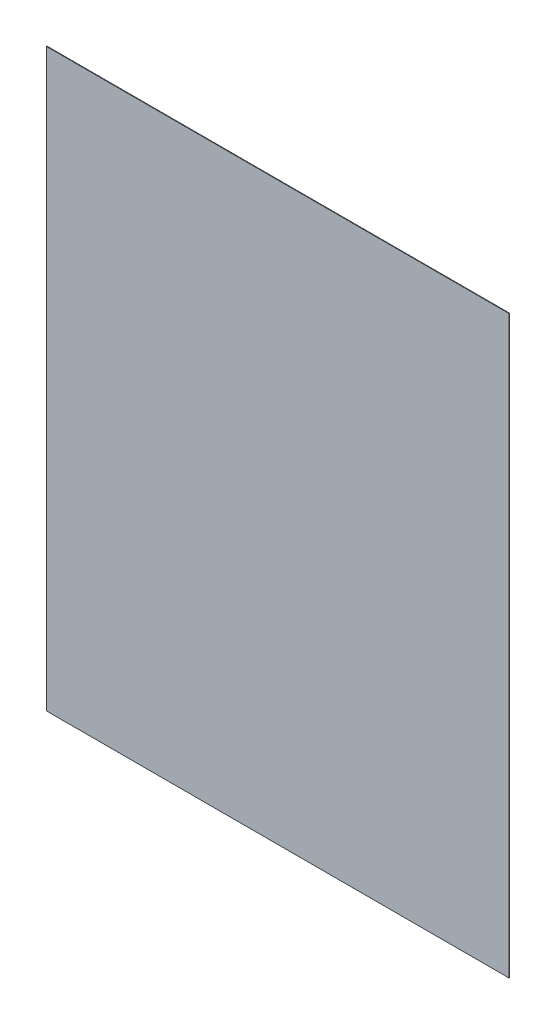
ISO-10303-21;
HEADER;
FILE_DESCRIPTION(('STEP AP214'),'2;1');
FILE_NAME('part.step','',(''),(''),'','','');
FILE_SCHEMA(('AUTOMOTIVE_DESIGN { 1 0 10303 214 1 1 1 1 }'));
ENDSEC;
DATA;
#1=APPLICATION_CONTEXT('core data for automotive mechanical design processes');
#2=APPLICATION_PROTOCOL_DEFINITION('international standard','automotive_design',2000,#1);
#3=PRODUCT_CONTEXT('',#1,'mechanical');
#4=PRODUCT('Part','Part','',(#3));
#5=PRODUCT_RELATED_PRODUCT_CATEGORY('part','',(#4));
#6=PRODUCT_DEFINITION_FORMATION('','',#4);
#7=PRODUCT_DEFINITION_CONTEXT('part definition',#1,'design');
#8=PRODUCT_DEFINITION('design','',#6,#7);
#9=PRODUCT_DEFINITION_SHAPE('','',#8);
#10=(LENGTH_UNIT() NAMED_UNIT(*) SI_UNIT(.MILLI.,.METRE.));
#11=(NAMED_UNIT(*) PLANE_ANGLE_UNIT() SI_UNIT($,.RADIAN.));
#12=(NAMED_UNIT(*) SI_UNIT($,.STERADIAN.) SOLID_ANGLE_UNIT());
#13=UNCERTAINTY_MEASURE_WITH_UNIT(LENGTH_MEASURE(1.E-05),#10,'distance_accuracy_value','');
#14=(GEOMETRIC_REPRESENTATION_CONTEXT(3) GLOBAL_UNCERTAINTY_ASSIGNED_CONTEXT((#13)) GLOBAL_UNIT_ASSIGNED_CONTEXT((#10,
#11,#12)) REPRESENTATION_CONTEXT('',''));
#15=CARTESIAN_POINT('',(0.,0.,0.));
#16=DIRECTION('',(0.,0.,1.));
#17=DIRECTION('',(1.,0.,0.));
#18=AXIS2_PLACEMENT_3D('',#15,#16,#17);
#19=CARTESIAN_POINT('',(-3.844875652337E-05,2.407803405612E-05,0.00100076));
#20=DIRECTION('',(0.,0.,1.));
#21=DIRECTION('',(1.,0.,0.));
#22=AXIS2_PLACEMENT_3D('',#19,#20,#21);
#23=PLANE('',#22);
#24=DIRECTION('',(0.999999999995025,-3.15433532354208E-06,0.));
#25=VECTOR('',#24,1.);
#26=CARTESIAN_POINT('',(-0.40269922,-0.50068226,0.00100076));
#27=LINE('',#26,#25);
#28=CARTESIAN_POINT('',(-0.40269922,-0.50068226,0.00100076));
#29=VERTEX_POINT('',#28);
#30=CARTESIAN_POINT('',(0.40254174,-0.5006848,0.00100076));
#31=VERTEX_POINT('',#30);
#32=EDGE_CURVE('E71',#29,#31,#27,.T.);
#33=ORIENTED_EDGE('',*,*,#32,.T.);
#34=DIRECTION('',(0.000159800728980178,0.999999987231863,0.));
#35=VECTOR('',#34,1.);
#36=CARTESIAN_POINT('',(0.40254174,-0.5006848,0.00100076));
#37=LINE('',#36,#35);
#38=CARTESIAN_POINT('',(0.40270176,0.50068734,0.00100076));
#39=VERTEX_POINT('',#38);
#40=EDGE_CURVE('E96',#31,#39,#37,.T.);
#41=ORIENTED_EDGE('',*,*,#40,.T.);
#42=DIRECTION('',(-1.,0.,0.));
#43=VECTOR('',#42,1.);
#44=CARTESIAN_POINT('',(0.40270176,0.50068734,0.00100076));
#45=LINE('',#44,#43);
#46=CARTESIAN_POINT('',(-0.40269922,0.50068734,0.00100076));
#47=VERTEX_POINT('',#46);
#48=EDGE_CURVE('E73',#39,#47,#45,.T.);
#49=ORIENTED_EDGE('',*,*,#48,.T.);
#50=DIRECTION('',(0.,-1.,0.));
#51=VECTOR('',#50,1.);
#52=CARTESIAN_POINT('',(-0.40269922,0.50068734,0.00100076));
#53=LINE('',#52,#51);
#54=EDGE_CURVE('E11',#47,#29,#53,.T.);
#55=ORIENTED_EDGE('',*,*,#54,.T.);
#56=EDGE_LOOP('',(#33,#41,#49,#55));
#57=FACE_BOUND('',#56,.T.);
#58=ADVANCED_FACE('F17',(#57),#23,.T.);
#59=CARTESIAN_POINT('',(-3.844875652337E-05,2.407803405612E-05,0.));
#60=DIRECTION('',(0.,0.,1.));
#61=DIRECTION('',(1.,0.,0.));
#62=AXIS2_PLACEMENT_3D('',#59,#60,#61);
#63=PLANE('',#62);
#64=DIRECTION('',(0.,-1.,0.));
#65=VECTOR('',#64,1.);
#66=CARTESIAN_POINT('',(-0.40269922,0.50068734,0.));
#67=LINE('',#66,#65);
#68=CARTESIAN_POINT('',(-0.40269922,0.50068734,0.));
#69=VERTEX_POINT('',#68);
#70=CARTESIAN_POINT('',(-0.40269922,-0.50068226,0.));
#71=VERTEX_POINT('',#70);
#72=EDGE_CURVE('E20',#69,#71,#67,.T.);
#73=ORIENTED_EDGE('',*,*,#72,.F.);
#74=DIRECTION('',(-1.,0.,0.));
#75=VECTOR('',#74,1.);
#76=CARTESIAN_POINT('',(0.40270176,0.50068734,0.));
#77=LINE('',#76,#75);
#78=CARTESIAN_POINT('',(0.40270176,0.50068734,0.));
#79=VERTEX_POINT('',#78);
#80=EDGE_CURVE('E100',#79,#69,#77,.T.);
#81=ORIENTED_EDGE('',*,*,#80,.F.);
#82=DIRECTION('',(0.000159800728980178,0.999999987231863,0.));
#83=VECTOR('',#82,1.);
#84=CARTESIAN_POINT('',(0.40254174,-0.5006848,0.));
#85=LINE('',#84,#83);
#86=CARTESIAN_POINT('',(0.40254174,-0.5006848,0.));
#87=VERTEX_POINT('',#86);
#88=EDGE_CURVE('E81',#87,#79,#85,.T.);
#89=ORIENTED_EDGE('',*,*,#88,.F.);
#90=DIRECTION('',(0.999999999995025,-3.15433532354208E-06,0.));
#91=VECTOR('',#90,1.);
#92=CARTESIAN_POINT('',(-0.40269922,-0.50068226,0.));
#93=LINE('',#92,#91);
#94=EDGE_CURVE('E92',#71,#87,#93,.T.);
#95=ORIENTED_EDGE('',*,*,#94,.F.);
#96=EDGE_LOOP('',(#73,#81,#89,#95));
#97=FACE_BOUND('',#96,.T.);
#98=ADVANCED_FACE('F123',(#97),#63,.F.);
#99=CARTESIAN_POINT('',(-0.40269922,0.50068734,0.));
#100=DIRECTION('',(1.,0.,0.));
#101=DIRECTION('',(0.,1.,0.));
#102=AXIS2_PLACEMENT_3D('',#99,#100,#101);
#103=PLANE('',#102);
#104=ORIENTED_EDGE('',*,*,#72,.T.);
#105=DIRECTION('',(0.,0.,1.));
#106=VECTOR('',#105,1.);
#107=CARTESIAN_POINT('',(-0.40269922,-0.50068226,0.));
#108=LINE('',#107,#106);
#109=EDGE_CURVE('E76',#71,#29,#108,.T.);
#110=ORIENTED_EDGE('',*,*,#109,.T.);
#111=ORIENTED_EDGE('',*,*,#54,.F.);
#112=DIRECTION('',(0.,0.,1.));
#113=VECTOR('',#112,1.);
#114=CARTESIAN_POINT('',(-0.40269922,0.50068734,0.));
#115=LINE('',#114,#113);
#116=EDGE_CURVE('E103',#69,#47,#115,.T.);
#117=ORIENTED_EDGE('',*,*,#116,.F.);
#118=EDGE_LOOP('',(#104,#110,#111,#117));
#119=FACE_BOUND('',#118,.T.);
#120=ADVANCED_FACE('F77',(#119),#103,.F.);
#121=CARTESIAN_POINT('',(0.40270176,0.50068734,0.));
#122=DIRECTION('',(0.,-1.,0.));
#123=DIRECTION('',(0.,0.,-1.));
#124=AXIS2_PLACEMENT_3D('',#121,#122,#123);
#125=PLANE('',#124);
#126=ORIENTED_EDGE('',*,*,#80,.T.);
#127=ORIENTED_EDGE('',*,*,#116,.T.);
#128=ORIENTED_EDGE('',*,*,#48,.F.);
#129=DIRECTION('',(0.,0.,1.));
#130=VECTOR('',#129,1.);
#131=CARTESIAN_POINT('',(0.40270176,0.50068734,0.));
#132=LINE('',#131,#130);
#133=EDGE_CURVE('E99',#79,#39,#132,.T.);
#134=ORIENTED_EDGE('',*,*,#133,.F.);
#135=EDGE_LOOP('',(#126,#127,#128,#134));
#136=FACE_BOUND('',#135,.T.);
#137=ADVANCED_FACE('F133',(#136),#125,.F.);
#138=CARTESIAN_POINT('',(0.40254174,-0.5006848,0.));
#139=DIRECTION('',(-0.999999987231863,0.000159800728980178,0.));
#140=DIRECTION('',(0.,0.,1.));
#141=AXIS2_PLACEMENT_3D('',#138,#139,#140);
#142=PLANE('',#141);
#143=ORIENTED_EDGE('',*,*,#88,.T.);
#144=ORIENTED_EDGE('',*,*,#133,.T.);
#145=ORIENTED_EDGE('',*,*,#40,.F.);
#146=DIRECTION('',(0.,0.,1.));
#147=VECTOR('',#146,1.);
#148=CARTESIAN_POINT('',(0.40254174,-0.5006848,0.));
#149=LINE('',#148,#147);
#150=EDGE_CURVE('E85',#87,#31,#149,.T.);
#151=ORIENTED_EDGE('',*,*,#150,.F.);
#152=EDGE_LOOP('',(#143,#144,#145,#151));
#153=FACE_BOUND('',#152,.T.);
#154=ADVANCED_FACE('F117',(#153),#142,.F.);
#155=CARTESIAN_POINT('',(-0.40269922,-0.50068226,0.));
#156=DIRECTION('',(3.15433532354208E-06,0.999999999995025,0.));
#157=DIRECTION('',(0.,0.,-1.));
#158=AXIS2_PLACEMENT_3D('',#155,#156,#157);
#159=PLANE('',#158);
#160=ORIENTED_EDGE('',*,*,#94,.T.);
#161=ORIENTED_EDGE('',*,*,#150,.T.);
#162=ORIENTED_EDGE('',*,*,#32,.F.);
#163=ORIENTED_EDGE('',*,*,#109,.F.);
#164=EDGE_LOOP('',(#160,#161,#162,#163));
#165=FACE_BOUND('',#164,.T.);
#166=ADVANCED_FACE('F83',(#165),#159,.F.);
#167=CLOSED_SHELL('',(#58,#98,#120,#137,#154,#166));
#168=MANIFOLD_SOLID_BREP('B1',#167);
#169=ADVANCED_BREP_SHAPE_REPRESENTATION('',(#18,#168),#14);
#170=SHAPE_DEFINITION_REPRESENTATION(#9,#169);
ENDSEC;
END-ISO-10303-21;
